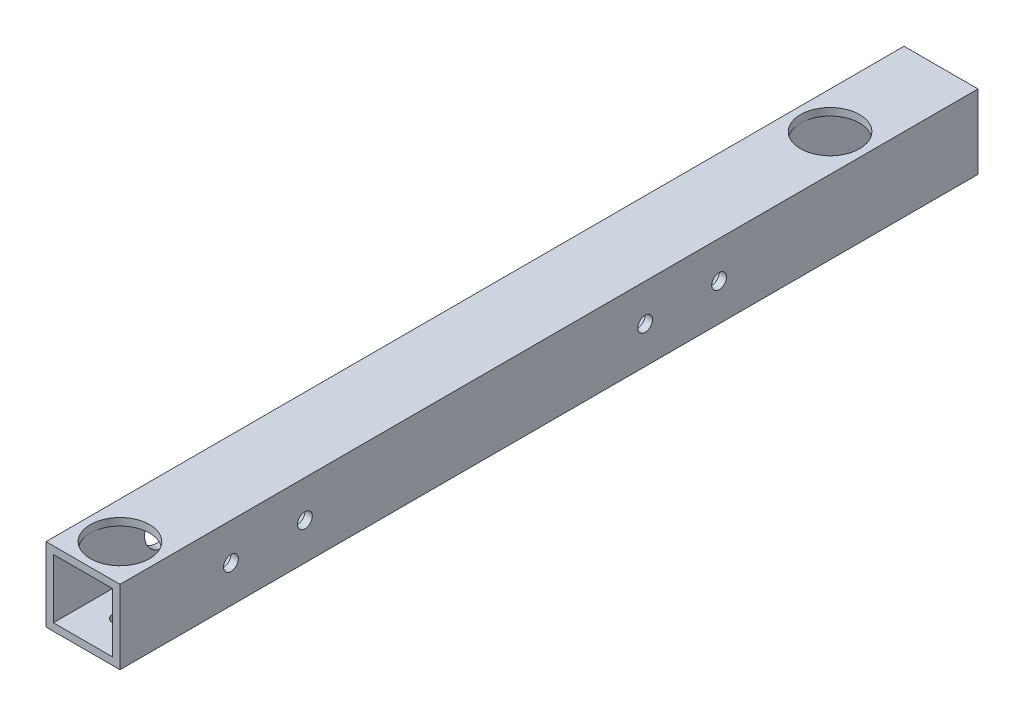
ISO-10303-21;
HEADER;
FILE_DESCRIPTION(('STEP AP214'),'2;1');
FILE_NAME('part.step','',(''),(''),'','','');
FILE_SCHEMA(('AUTOMOTIVE_DESIGN { 1 0 10303 214 1 1 1 1 }'));
ENDSEC;
DATA;
#1=APPLICATION_CONTEXT('core data for automotive mechanical design processes');
#2=APPLICATION_PROTOCOL_DEFINITION('international standard','automotive_design',2000,#1);
#3=PRODUCT_CONTEXT('',#1,'mechanical');
#4=PRODUCT('Part','Part','',(#3));
#5=PRODUCT_RELATED_PRODUCT_CATEGORY('part','',(#4));
#6=PRODUCT_DEFINITION_FORMATION('','',#4);
#7=PRODUCT_DEFINITION_CONTEXT('part definition',#1,'design');
#8=PRODUCT_DEFINITION('design','',#6,#7);
#9=PRODUCT_DEFINITION_SHAPE('','',#8);
#10=(LENGTH_UNIT() NAMED_UNIT(*) SI_UNIT(.MILLI.,.METRE.));
#11=(NAMED_UNIT(*) PLANE_ANGLE_UNIT() SI_UNIT($,.RADIAN.));
#12=(NAMED_UNIT(*) SI_UNIT($,.STERADIAN.) SOLID_ANGLE_UNIT());
#13=UNCERTAINTY_MEASURE_WITH_UNIT(LENGTH_MEASURE(1.E-05),#10,'distance_accuracy_value','');
#14=(GEOMETRIC_REPRESENTATION_CONTEXT(3) GLOBAL_UNCERTAINTY_ASSIGNED_CONTEXT((#13)) GLOBAL_UNIT_ASSIGNED_CONTEXT((#10,
#11,#12)) REPRESENTATION_CONTEXT('',''));
#15=CARTESIAN_POINT('',(0.,0.,0.));
#16=DIRECTION('',(0.,0.,1.));
#17=DIRECTION('',(1.,0.,0.));
#18=AXIS2_PLACEMENT_3D('',#15,#16,#17);
#19=CARTESIAN_POINT('',(-5.51008414074451,6.23262608579252,174.));
#20=DIRECTION('',(0.,-1.,0.));
#21=DIRECTION('',(0.,0.,-1.));
#22=AXIS2_PLACEMENT_3D('',#19,#20,#21);
#23=PLANE('',#22);
#24=CARTESIAN_POINT('',(0.489915859255486,6.23262608579252,166.5));
#25=DIRECTION('',(0.,-1.,0.));
#26=DIRECTION('',(0.,0.,-1.));
#27=AXIS2_PLACEMENT_3D('',#24,#25,#26);
#28=CIRCLE('',#27,6.);
#29=CARTESIAN_POINT('',(6.48991585925549,6.23262608579252,166.5));
#30=VERTEX_POINT('',#29);
#31=CARTESIAN_POINT('',(-5.51008414074451,6.23262608579252,166.5));
#32=VERTEX_POINT('',#31);
#33=EDGE_CURVE('E49',#30,#32,#28,.T.);
#34=ORIENTED_EDGE('',*,*,#33,.F.);
#35=DIRECTION('',(0.,0.,-1.));
#36=VECTOR('',#35,1.);
#37=CARTESIAN_POINT('',(6.48991585925549,6.23262608579252,174.));
#38=LINE('',#37,#36);
#39=CARTESIAN_POINT('',(6.48991585925549,6.23262608579252,174.));
#40=VERTEX_POINT('',#39);
#41=EDGE_CURVE('E118',#40,#30,#38,.T.);
#42=ORIENTED_EDGE('',*,*,#41,.F.);
#43=DIRECTION('',(-1.,0.,0.));
#44=VECTOR('',#43,1.);
#45=CARTESIAN_POINT('',(-5.51008414074451,6.23262608579252,174.));
#46=LINE('',#45,#44);
#47=CARTESIAN_POINT('',(-5.51008414074451,6.23262608579252,174.));
#48=VERTEX_POINT('',#47);
#49=EDGE_CURVE('E144',#40,#48,#46,.T.);
#50=ORIENTED_EDGE('',*,*,#49,.T.);
#51=DIRECTION('',(0.,0.,-1.));
#52=VECTOR('',#51,1.);
#53=CARTESIAN_POINT('',(-5.51008414074451,6.23262608579252,174.));
#54=LINE('',#53,#52);
#55=EDGE_CURVE('E121',#48,#32,#54,.T.);
#56=ORIENTED_EDGE('',*,*,#55,.T.);
#57=EDGE_LOOP('',(#34,#42,#50,#56));
#58=FACE_BOUND('',#57,.T.);
#59=ADVANCED_FACE('F33',(#58),#23,.T.);
#60=EDGE_CURVE('E109',#32,#30,#28,.T.);
#61=ORIENTED_EDGE('',*,*,#60,.F.);
#62=CARTESIAN_POINT('',(-5.51008414074451,6.23262608579252,22.5));
#63=VERTEX_POINT('',#62);
#64=EDGE_CURVE('E56',#32,#63,#54,.T.);
#65=ORIENTED_EDGE('',*,*,#64,.T.);
#66=CARTESIAN_POINT('',(0.489915859255489,6.23262608579252,22.5));
#67=DIRECTION('',(0.,-1.,0.));
#68=DIRECTION('',(0.,0.,-1.));
#69=AXIS2_PLACEMENT_3D('',#66,#67,#68);
#70=CIRCLE('',#69,6.);
#71=CARTESIAN_POINT('',(6.48991585925549,6.23262608579252,22.5));
#72=VERTEX_POINT('',#71);
#73=EDGE_CURVE('E11',#72,#63,#70,.T.);
#74=ORIENTED_EDGE('',*,*,#73,.F.);
#75=EDGE_CURVE('E123',#30,#72,#38,.T.);
#76=ORIENTED_EDGE('',*,*,#75,.F.);
#77=EDGE_LOOP('',(#61,#65,#74,#76));
#78=FACE_BOUND('',#77,.T.);
#79=ADVANCED_FACE('F124',(#78),#23,.T.);
#80=CARTESIAN_POINT('',(0.,0.,174.));
#81=DIRECTION('',(0.,0.,1.));
#82=DIRECTION('',(1.,0.,0.));
#83=AXIS2_PLACEMENT_3D('',#80,#81,#82);
#84=PLANE('',#83);
#85=DIRECTION('',(0.,-1.,0.));
#86=VECTOR('',#85,1.);
#87=CARTESIAN_POINT('',(-7.01008414074451,7.73262608579252,174.));
#88=LINE('',#87,#86);
#89=CARTESIAN_POINT('',(-7.01008414074451,7.73262608579252,174.));
#90=VERTEX_POINT('',#89);
#91=CARTESIAN_POINT('',(-7.01008414074451,-7.26737391420748,174.));
#92=VERTEX_POINT('',#91);
#93=EDGE_CURVE('E336',#90,#92,#88,.T.);
#94=ORIENTED_EDGE('',*,*,#93,.T.);
#95=DIRECTION('',(1.,0.,0.));
#96=VECTOR('',#95,1.);
#97=CARTESIAN_POINT('',(-7.01008414074451,-7.26737391420748,174.));
#98=LINE('',#97,#96);
#99=CARTESIAN_POINT('',(7.98991585925548,-7.26737391420748,174.));
#100=VERTEX_POINT('',#99);
#101=EDGE_CURVE('E339',#92,#100,#98,.T.);
#102=ORIENTED_EDGE('',*,*,#101,.T.);
#103=DIRECTION('',(0.,1.,0.));
#104=VECTOR('',#103,1.);
#105=CARTESIAN_POINT('',(7.98991585925549,7.73262608579252,174.));
#106=LINE('',#105,#104);
#107=CARTESIAN_POINT('',(7.98991585925549,7.73262608579252,174.));
#108=VERTEX_POINT('',#107);
#109=EDGE_CURVE('E412',#100,#108,#106,.T.);
#110=ORIENTED_EDGE('',*,*,#109,.T.);
#111=DIRECTION('',(-1.,0.,0.));
#112=VECTOR('',#111,1.);
#113=CARTESIAN_POINT('',(-7.01008414074451,7.73262608579252,174.));
#114=LINE('',#113,#112);
#115=EDGE_CURVE('E329',#108,#90,#114,.T.);
#116=ORIENTED_EDGE('',*,*,#115,.T.);
#117=EDGE_LOOP('',(#94,#102,#110,#116));
#118=FACE_BOUND('',#117,.T.);
#119=DIRECTION('',(1.,0.,0.));
#120=VECTOR('',#119,1.);
#121=CARTESIAN_POINT('',(-5.51008414074451,-5.76737391420748,174.));
#122=LINE('',#121,#120);
#123=CARTESIAN_POINT('',(-5.51008414074451,-5.76737391420748,174.));
#124=VERTEX_POINT('',#123);
#125=CARTESIAN_POINT('',(6.48991585925549,-5.76737391420748,174.));
#126=VERTEX_POINT('',#125);
#127=EDGE_CURVE('E150',#124,#126,#122,.T.);
#128=ORIENTED_EDGE('',*,*,#127,.F.);
#129=DIRECTION('',(0.,-1.,0.));
#130=VECTOR('',#129,1.);
#131=CARTESIAN_POINT('',(-5.51008414074451,6.23262608579252,174.));
#132=LINE('',#131,#130);
#133=EDGE_CURVE('E165',#48,#124,#132,.T.);
#134=ORIENTED_EDGE('',*,*,#133,.F.);
#135=ORIENTED_EDGE('',*,*,#49,.F.);
#136=DIRECTION('',(0.,1.,0.));
#137=VECTOR('',#136,1.);
#138=CARTESIAN_POINT('',(6.48991585925549,6.23262608579252,174.));
#139=LINE('',#138,#137);
#140=EDGE_CURVE('E134',#126,#40,#139,.T.);
#141=ORIENTED_EDGE('',*,*,#140,.F.);
#142=EDGE_LOOP('',(#128,#134,#135,#141));
#143=FACE_BOUND('',#142,.T.);
#144=ADVANCED_FACE('F359',(#118,#143),#84,.T.);
#145=CARTESIAN_POINT('',(0.,0.,0.));
#146=DIRECTION('',(0.,0.,1.));
#147=DIRECTION('',(1.,0.,0.));
#148=AXIS2_PLACEMENT_3D('',#145,#146,#147);
#149=PLANE('',#148);
#150=DIRECTION('',(0.,-1.,0.));
#151=VECTOR('',#150,1.);
#152=CARTESIAN_POINT('',(-7.01008414074451,7.73262608579252,0.));
#153=LINE('',#152,#151);
#154=CARTESIAN_POINT('',(-7.01008414074451,7.73262608579252,0.));
#155=VERTEX_POINT('',#154);
#156=CARTESIAN_POINT('',(-7.01008414074451,-7.26737391420748,0.));
#157=VERTEX_POINT('',#156);
#158=EDGE_CURVE('E335',#155,#157,#153,.T.);
#159=ORIENTED_EDGE('',*,*,#158,.F.);
#160=DIRECTION('',(-1.,0.,0.));
#161=VECTOR('',#160,1.);
#162=CARTESIAN_POINT('',(-7.01008414074451,7.73262608579252,0.));
#163=LINE('',#162,#161);
#164=CARTESIAN_POINT('',(7.98991585925549,7.73262608579252,0.));
#165=VERTEX_POINT('',#164);
#166=EDGE_CURVE('E323',#165,#155,#163,.T.);
#167=ORIENTED_EDGE('',*,*,#166,.F.);
#168=DIRECTION('',(0.,1.,0.));
#169=VECTOR('',#168,1.);
#170=CARTESIAN_POINT('',(7.98991585925549,7.73262608579252,0.));
#171=LINE('',#170,#169);
#172=CARTESIAN_POINT('',(7.98991585925548,-7.26737391420748,0.));
#173=VERTEX_POINT('',#172);
#174=EDGE_CURVE('E314',#173,#165,#171,.T.);
#175=ORIENTED_EDGE('',*,*,#174,.F.);
#176=DIRECTION('',(1.,0.,0.));
#177=VECTOR('',#176,1.);
#178=CARTESIAN_POINT('',(-7.01008414074451,-7.26737391420748,0.));
#179=LINE('',#178,#177);
#180=EDGE_CURVE('E324',#157,#173,#179,.T.);
#181=ORIENTED_EDGE('',*,*,#180,.F.);
#182=EDGE_LOOP('',(#159,#167,#175,#181));
#183=FACE_BOUND('',#182,.T.);
#184=DIRECTION('',(0.,-1.,0.));
#185=VECTOR('',#184,1.);
#186=CARTESIAN_POINT('',(-5.51008414074451,6.23262608579252,0.));
#187=LINE('',#186,#185);
#188=CARTESIAN_POINT('',(-5.51008414074451,6.23262608579252,0.));
#189=VERTEX_POINT('',#188);
#190=CARTESIAN_POINT('',(-5.51008414074451,-5.76737391420748,0.));
#191=VERTEX_POINT('',#190);
#192=EDGE_CURVE('E154',#189,#191,#187,.T.);
#193=ORIENTED_EDGE('',*,*,#192,.T.);
#194=DIRECTION('',(1.,0.,0.));
#195=VECTOR('',#194,1.);
#196=CARTESIAN_POINT('',(-5.51008414074451,-5.76737391420748,0.));
#197=LINE('',#196,#195);
#198=CARTESIAN_POINT('',(6.48991585925549,-5.76737391420748,0.));
#199=VERTEX_POINT('',#198);
#200=EDGE_CURVE('E157',#191,#199,#197,.T.);
#201=ORIENTED_EDGE('',*,*,#200,.T.);
#202=DIRECTION('',(0.,1.,0.));
#203=VECTOR('',#202,1.);
#204=CARTESIAN_POINT('',(6.48991585925549,6.23262608579252,0.));
#205=LINE('',#204,#203);
#206=CARTESIAN_POINT('',(6.48991585925549,6.23262608579252,0.));
#207=VERTEX_POINT('',#206);
#208=EDGE_CURVE('E161',#199,#207,#205,.T.);
#209=ORIENTED_EDGE('',*,*,#208,.T.);
#210=DIRECTION('',(-1.,0.,0.));
#211=VECTOR('',#210,1.);
#212=CARTESIAN_POINT('',(-5.51008414074451,6.23262608579252,0.));
#213=LINE('',#212,#211);
#214=EDGE_CURVE('E163',#207,#189,#213,.T.);
#215=ORIENTED_EDGE('',*,*,#214,.T.);
#216=EDGE_LOOP('',(#193,#201,#209,#215));
#217=FACE_BOUND('',#216,.T.);
#218=ADVANCED_FACE('F333',(#183,#217),#149,.F.);
#219=CARTESIAN_POINT('',(-7.01008414074451,7.73262608579252,174.));
#220=DIRECTION('',(1.,0.,0.));
#221=DIRECTION('',(0.,1.,0.));
#222=AXIS2_PLACEMENT_3D('',#219,#220,#221);
#223=PLANE('',#222);
#224=CARTESIAN_POINT('',(-7.01008414074451,0.232626085792519,136.5));
#225=DIRECTION('',(-1.,0.,0.));
#226=DIRECTION('',(0.,-1.,0.));
#227=AXIS2_PLACEMENT_3D('',#224,#225,#226);
#228=CIRCLE('',#227,3.99999999999999);
#229=CARTESIAN_POINT('',(-7.01008414074451,-3.76737391420747,136.5));
#230=VERTEX_POINT('',#229);
#231=EDGE_CURVE('E232',#230,#230,#228,.T.);
#232=ORIENTED_EDGE('',*,*,#231,.F.);
#233=EDGE_LOOP('',(#232));
#234=FACE_BOUND('',#233,.T.);
#235=CARTESIAN_POINT('',(-7.01008414074451,0.232626085792519,67.5));
#236=DIRECTION('',(-1.,0.,0.));
#237=DIRECTION('',(0.,-1.,0.));
#238=AXIS2_PLACEMENT_3D('',#235,#236,#237);
#239=CIRCLE('',#238,4.00000000000001);
#240=CARTESIAN_POINT('',(-7.01008414074451,-3.76737391420749,67.5));
#241=VERTEX_POINT('',#240);
#242=EDGE_CURVE('E221',#241,#241,#239,.T.);
#243=ORIENTED_EDGE('',*,*,#242,.F.);
#244=EDGE_LOOP('',(#243));
#245=FACE_BOUND('',#244,.T.);
#246=CARTESIAN_POINT('',(-7.01008414074451,0.232626085792518,116.8));
#247=DIRECTION('',(-1.,0.,0.));
#248=DIRECTION('',(0.,-1.,0.));
#249=AXIS2_PLACEMENT_3D('',#246,#247,#248);
#250=CIRCLE('',#249,1.5);
#251=CARTESIAN_POINT('',(-7.01008414074451,-1.26737391420748,116.8));
#252=VERTEX_POINT('',#251);
#253=EDGE_CURVE('E201',#252,#252,#250,.T.);
#254=ORIENTED_EDGE('',*,*,#253,.F.);
#255=EDGE_LOOP('',(#254));
#256=FACE_BOUND('',#255,.T.);
#257=CARTESIAN_POINT('',(-7.01008414074451,0.232626085792518,86.8));
#258=DIRECTION('',(-1.,0.,0.));
#259=DIRECTION('',(0.,-1.,0.));
#260=AXIS2_PLACEMENT_3D('',#257,#258,#259);
#261=CIRCLE('',#260,1.5);
#262=CARTESIAN_POINT('',(-7.01008414074451,-1.26737391420748,86.8));
#263=VERTEX_POINT('',#262);
#264=EDGE_CURVE('E193',#263,#263,#261,.T.);
#265=ORIENTED_EDGE('',*,*,#264,.F.);
#266=EDGE_LOOP('',(#265));
#267=FACE_BOUND('',#266,.T.);
#268=CARTESIAN_POINT('',(-7.01008414074451,0.232626085792515,151.5));
#269=DIRECTION('',(-1.,0.,0.));
#270=DIRECTION('',(0.,-1.,0.));
#271=AXIS2_PLACEMENT_3D('',#268,#269,#270);
#272=CIRCLE('',#271,3.99999999999999);
#273=CARTESIAN_POINT('',(-7.01008414074451,-3.76737391420748,151.5));
#274=VERTEX_POINT('',#273);
#275=EDGE_CURVE('E189',#274,#274,#272,.T.);
#276=ORIENTED_EDGE('',*,*,#275,.F.);
#277=EDGE_LOOP('',(#276));
#278=FACE_BOUND('',#277,.T.);
#279=CARTESIAN_POINT('',(-7.01008414074451,0.232626085792518,52.5));
#280=DIRECTION('',(-1.,0.,0.));
#281=DIRECTION('',(0.,-1.,0.));
#282=AXIS2_PLACEMENT_3D('',#279,#280,#281);
#283=CIRCLE('',#282,4.);
#284=CARTESIAN_POINT('',(-7.01008414074451,-3.76737391420748,52.5));
#285=VERTEX_POINT('',#284);
#286=EDGE_CURVE('E181',#285,#285,#283,.T.);
#287=ORIENTED_EDGE('',*,*,#286,.F.);
#288=EDGE_LOOP('',(#287));
#289=FACE_BOUND('',#288,.T.);
#290=ORIENTED_EDGE('',*,*,#158,.T.);
#291=DIRECTION('',(0.,0.,-1.));
#292=VECTOR('',#291,1.);
#293=CARTESIAN_POINT('',(-7.01008414074451,-7.26737391420748,174.));
#294=LINE('',#293,#292);
#295=EDGE_CURVE('E277',#92,#157,#294,.T.);
#296=ORIENTED_EDGE('',*,*,#295,.F.);
#297=ORIENTED_EDGE('',*,*,#93,.F.);
#298=DIRECTION('',(0.,0.,-1.));
#299=VECTOR('',#298,1.);
#300=CARTESIAN_POINT('',(-7.01008414074451,7.73262608579252,174.));
#301=LINE('',#300,#299);
#302=EDGE_CURVE('E330',#90,#155,#301,.T.);
#303=ORIENTED_EDGE('',*,*,#302,.T.);
#304=EDGE_LOOP('',(#290,#296,#297,#303));
#305=FACE_BOUND('',#304,.T.);
#306=ADVANCED_FACE('F35',(#234,#245,#256,#267,#278,#289,#305),#223,.F.);
#307=CARTESIAN_POINT('',(-7.01008414074451,-7.26737391420748,174.));
#308=DIRECTION('',(0.,1.,0.));
#309=DIRECTION('',(0.,0.,1.));
#310=AXIS2_PLACEMENT_3D('',#307,#308,#309);
#311=PLANE('',#310);
#312=CARTESIAN_POINT('',(0.489915859255487,-7.26737391420748,166.5));
#313=DIRECTION('',(0.,-1.,0.));
#314=DIRECTION('',(0.,0.,-1.));
#315=AXIS2_PLACEMENT_3D('',#312,#313,#314);
#316=CIRCLE('',#315,1.5);
#317=CARTESIAN_POINT('',(0.489915859255487,-7.26737391420748,165.));
#318=VERTEX_POINT('',#317);
#319=EDGE_CURVE('E122',#318,#318,#316,.T.);
#320=ORIENTED_EDGE('',*,*,#319,.F.);
#321=EDGE_LOOP('',(#320));
#322=FACE_BOUND('',#321,.T.);
#323=CARTESIAN_POINT('',(0.489915859255487,-7.26737391420748,22.5));
#324=DIRECTION('',(0.,-1.,0.));
#325=DIRECTION('',(0.,0.,-1.));
#326=AXIS2_PLACEMENT_3D('',#323,#324,#325);
#327=CIRCLE('',#326,1.5);
#328=CARTESIAN_POINT('',(0.489915859255487,-7.26737391420748,21.));
#329=VERTEX_POINT('',#328);
#330=EDGE_CURVE('E209',#329,#329,#327,.T.);
#331=ORIENTED_EDGE('',*,*,#330,.F.);
#332=EDGE_LOOP('',(#331));
#333=FACE_BOUND('',#332,.T.);
#334=CARTESIAN_POINT('',(0.489915859255486,-7.26737391420748,116.8));
#335=DIRECTION('',(0.,-1.,0.));
#336=DIRECTION('',(0.,0.,-1.));
#337=AXIS2_PLACEMENT_3D('',#334,#335,#336);
#338=CIRCLE('',#337,4.);
#339=CARTESIAN_POINT('',(0.489915859255486,-7.26737391420748,112.8));
#340=VERTEX_POINT('',#339);
#341=EDGE_CURVE('E205',#340,#340,#338,.T.);
#342=ORIENTED_EDGE('',*,*,#341,.F.);
#343=EDGE_LOOP('',(#342));
#344=FACE_BOUND('',#343,.T.);
#345=CARTESIAN_POINT('',(0.489915859255486,-7.26737391420748,86.8));
#346=DIRECTION('',(0.,-1.,0.));
#347=DIRECTION('',(0.,0.,-1.));
#348=AXIS2_PLACEMENT_3D('',#345,#346,#347);
#349=CIRCLE('',#348,4.);
#350=CARTESIAN_POINT('',(0.489915859255486,-7.26737391420748,82.8));
#351=VERTEX_POINT('',#350);
#352=EDGE_CURVE('E197',#351,#351,#349,.T.);
#353=ORIENTED_EDGE('',*,*,#352,.F.);
#354=EDGE_LOOP('',(#353));
#355=FACE_BOUND('',#354,.T.);
#356=CARTESIAN_POINT('',(0.489915859255487,-7.26737391420748,7.5));
#357=DIRECTION('',(0.,-1.,0.));
#358=DIRECTION('',(0.,0.,-1.));
#359=AXIS2_PLACEMENT_3D('',#356,#357,#358);
#360=CIRCLE('',#359,1.5);
#361=CARTESIAN_POINT('',(0.489915859255487,-7.26737391420748,6.));
#362=VERTEX_POINT('',#361);
#363=EDGE_CURVE('E173',#362,#362,#360,.T.);
#364=ORIENTED_EDGE('',*,*,#363,.F.);
#365=EDGE_LOOP('',(#364));
#366=FACE_BOUND('',#365,.T.);
#367=ORIENTED_EDGE('',*,*,#180,.T.);
#368=DIRECTION('',(0.,0.,-1.));
#369=VECTOR('',#368,1.);
#370=CARTESIAN_POINT('',(7.98991585925548,-7.26737391420748,174.));
#371=LINE('',#370,#369);
#372=EDGE_CURVE('E320',#100,#173,#371,.T.);
#373=ORIENTED_EDGE('',*,*,#372,.F.);
#374=ORIENTED_EDGE('',*,*,#101,.F.);
#375=ORIENTED_EDGE('',*,*,#295,.T.);
#376=EDGE_LOOP('',(#367,#373,#374,#375));
#377=FACE_BOUND('',#376,.T.);
#378=ADVANCED_FACE('F304',(#322,#333,#344,#355,#366,#377),#311,.F.);
#379=CARTESIAN_POINT('',(7.98991585925549,7.73262608579252,174.));
#380=DIRECTION('',(-1.,0.,0.));
#381=DIRECTION('',(0.,-1.,0.));
#382=AXIS2_PLACEMENT_3D('',#379,#380,#381);
#383=PLANE('',#382);
#384=CARTESIAN_POINT('',(7.98991585925548,0.232626085792518,136.5));
#385=DIRECTION('',(1.,0.,0.));
#386=DIRECTION('',(0.,1.,0.));
#387=AXIS2_PLACEMENT_3D('',#384,#385,#386);
#388=CIRCLE('',#387,1.5);
#389=CARTESIAN_POINT('',(7.98991585925548,1.73262608579252,136.5));
#390=VERTEX_POINT('',#389);
#391=EDGE_CURVE('E229',#390,#390,#388,.T.);
#392=ORIENTED_EDGE('',*,*,#391,.F.);
#393=EDGE_LOOP('',(#392));
#394=FACE_BOUND('',#393,.T.);
#395=CARTESIAN_POINT('',(7.98991585925548,0.232626085792519,67.5));
#396=DIRECTION('',(1.,0.,0.));
#397=DIRECTION('',(0.,1.,0.));
#398=AXIS2_PLACEMENT_3D('',#395,#396,#397);
#399=CIRCLE('',#398,1.5);
#400=CARTESIAN_POINT('',(7.98991585925548,1.73262608579252,67.5));
#401=VERTEX_POINT('',#400);
#402=EDGE_CURVE('E225',#401,#401,#399,.T.);
#403=ORIENTED_EDGE('',*,*,#402,.F.);
#404=EDGE_LOOP('',(#403));
#405=FACE_BOUND('',#404,.T.);
#406=CARTESIAN_POINT('',(7.98991585925548,0.232626085792518,151.5));
#407=DIRECTION('',(1.,0.,0.));
#408=DIRECTION('',(0.,1.,0.));
#409=AXIS2_PLACEMENT_3D('',#406,#407,#408);
#410=CIRCLE('',#409,1.5);
#411=CARTESIAN_POINT('',(7.98991585925548,1.73262608579252,151.5));
#412=VERTEX_POINT('',#411);
#413=EDGE_CURVE('E185',#412,#412,#410,.T.);
#414=ORIENTED_EDGE('',*,*,#413,.F.);
#415=EDGE_LOOP('',(#414));
#416=FACE_BOUND('',#415,.T.);
#417=CARTESIAN_POINT('',(7.98991585925548,0.232626085792512,52.5));
#418=DIRECTION('',(1.,0.,0.));
#419=DIRECTION('',(0.,1.,0.));
#420=AXIS2_PLACEMENT_3D('',#417,#418,#419);
#421=CIRCLE('',#420,1.5);
#422=CARTESIAN_POINT('',(7.98991585925548,1.73262608579252,52.5));
#423=VERTEX_POINT('',#422);
#424=EDGE_CURVE('E177',#423,#423,#421,.T.);
#425=ORIENTED_EDGE('',*,*,#424,.F.);
#426=EDGE_LOOP('',(#425));
#427=FACE_BOUND('',#426,.T.);
#428=ORIENTED_EDGE('',*,*,#174,.T.);
#429=DIRECTION('',(0.,0.,-1.));
#430=VECTOR('',#429,1.);
#431=CARTESIAN_POINT('',(7.98991585925549,7.73262608579252,174.));
#432=LINE('',#431,#430);
#433=EDGE_CURVE('E317',#108,#165,#432,.T.);
#434=ORIENTED_EDGE('',*,*,#433,.F.);
#435=ORIENTED_EDGE('',*,*,#109,.F.);
#436=ORIENTED_EDGE('',*,*,#372,.T.);
#437=EDGE_LOOP('',(#428,#434,#435,#436));
#438=FACE_BOUND('',#437,.T.);
#439=ADVANCED_FACE('F301',(#394,#405,#416,#427,#438),#383,.F.);
#440=CARTESIAN_POINT('',(-7.01008414074451,7.73262608579252,174.));
#441=DIRECTION('',(0.,-1.,0.));
#442=DIRECTION('',(0.,0.,-1.));
#443=AXIS2_PLACEMENT_3D('',#440,#441,#442);
#444=PLANE('',#443);
#445=CARTESIAN_POINT('',(0.489915859255486,7.73262608579252,166.5));
#446=DIRECTION('',(0.,1.,0.));
#447=DIRECTION('',(0.,0.,1.));
#448=AXIS2_PLACEMENT_3D('',#445,#446,#447);
#449=CIRCLE('',#448,6.);
#450=CARTESIAN_POINT('',(0.489915859255486,7.73262608579252,172.5));
#451=VERTEX_POINT('',#450);
#452=EDGE_CURVE('E113',#451,#451,#449,.T.);
#453=ORIENTED_EDGE('',*,*,#452,.F.);
#454=EDGE_LOOP('',(#453));
#455=FACE_BOUND('',#454,.T.);
#456=CARTESIAN_POINT('',(0.489915859255489,7.73262608579252,22.5));
#457=DIRECTION('',(0.,1.,0.));
#458=DIRECTION('',(0.,0.,1.));
#459=AXIS2_PLACEMENT_3D('',#456,#457,#458);
#460=CIRCLE('',#459,6.);
#461=CARTESIAN_POINT('',(0.489915859255489,7.73262608579252,28.5));
#462=VERTEX_POINT('',#461);
#463=EDGE_CURVE('E212',#462,#462,#460,.T.);
#464=ORIENTED_EDGE('',*,*,#463,.F.);
#465=EDGE_LOOP('',(#464));
#466=FACE_BOUND('',#465,.T.);
#467=ORIENTED_EDGE('',*,*,#166,.T.);
#468=ORIENTED_EDGE('',*,*,#302,.F.);
#469=ORIENTED_EDGE('',*,*,#115,.F.);
#470=ORIENTED_EDGE('',*,*,#433,.T.);
#471=EDGE_LOOP('',(#467,#468,#469,#470));
#472=FACE_BOUND('',#471,.T.);
#473=ADVANCED_FACE('F245',(#455,#466,#472),#444,.F.);
#474=CARTESIAN_POINT('',(-5.51008414074451,6.23262608579252,174.));
#475=DIRECTION('',(1.,0.,0.));
#476=DIRECTION('',(0.,1.,0.));
#477=AXIS2_PLACEMENT_3D('',#474,#475,#476);
#478=PLANE('',#477);
#479=CARTESIAN_POINT('',(-5.51008414074451,0.232626085792519,136.5));
#480=DIRECTION('',(1.,0.,0.));
#481=DIRECTION('',(0.,1.,0.));
#482=AXIS2_PLACEMENT_3D('',#479,#480,#481);
#483=CIRCLE('',#482,3.99999999999999);
#484=CARTESIAN_POINT('',(-5.51008414074451,4.23262608579251,136.5));
#485=VERTEX_POINT('',#484);
#486=EDGE_CURVE('E37',#485,#485,#483,.T.);
#487=ORIENTED_EDGE('',*,*,#486,.F.);
#488=EDGE_LOOP('',(#487));
#489=FACE_BOUND('',#488,.T.);
#490=CARTESIAN_POINT('',(-5.51008414074451,0.232626085792519,67.5));
#491=DIRECTION('',(1.,0.,0.));
#492=DIRECTION('',(0.,1.,0.));
#493=AXIS2_PLACEMENT_3D('',#490,#491,#492);
#494=CIRCLE('',#493,4.00000000000001);
#495=CARTESIAN_POINT('',(-5.51008414074451,4.23262608579253,67.5));
#496=VERTEX_POINT('',#495);
#497=EDGE_CURVE('E220',#496,#496,#494,.T.);
#498=ORIENTED_EDGE('',*,*,#497,.F.);
#499=EDGE_LOOP('',(#498));
#500=FACE_BOUND('',#499,.T.);
#501=ORIENTED_EDGE('',*,*,#64,.F.);
#502=ORIENTED_EDGE('',*,*,#55,.F.);
#503=ORIENTED_EDGE('',*,*,#133,.T.);
#504=DIRECTION('',(0.,0.,-1.));
#505=VECTOR('',#504,1.);
#506=CARTESIAN_POINT('',(-5.51008414074451,-5.76737391420748,174.));
#507=LINE('',#506,#505);
#508=EDGE_CURVE('E137',#124,#191,#507,.T.);
#509=ORIENTED_EDGE('',*,*,#508,.T.);
#510=ORIENTED_EDGE('',*,*,#192,.F.);
#511=EDGE_CURVE('E142',#63,#189,#54,.T.);
#512=ORIENTED_EDGE('',*,*,#511,.F.);
#513=EDGE_LOOP('',(#501,#502,#503,#509,#510,#512));
#514=FACE_BOUND('',#513,.T.);
#515=CARTESIAN_POINT('',(-5.51008414074451,0.232626085792519,116.8));
#516=DIRECTION('',(1.,0.,0.));
#517=DIRECTION('',(0.,1.,0.));
#518=AXIS2_PLACEMENT_3D('',#515,#516,#517);
#519=CIRCLE('',#518,1.5);
#520=CARTESIAN_POINT('',(-5.51008414074451,1.73262608579252,116.8));
#521=VERTEX_POINT('',#520);
#522=EDGE_CURVE('E200',#521,#521,#519,.T.);
#523=ORIENTED_EDGE('',*,*,#522,.F.);
#524=EDGE_LOOP('',(#523));
#525=FACE_BOUND('',#524,.T.);
#526=CARTESIAN_POINT('',(-5.51008414074451,0.232626085792519,86.8));
#527=DIRECTION('',(1.,0.,0.));
#528=DIRECTION('',(0.,1.,0.));
#529=AXIS2_PLACEMENT_3D('',#526,#527,#528);
#530=CIRCLE('',#529,1.5);
#531=CARTESIAN_POINT('',(-5.51008414074451,1.73262608579252,86.8));
#532=VERTEX_POINT('',#531);
#533=EDGE_CURVE('E192',#532,#532,#530,.T.);
#534=ORIENTED_EDGE('',*,*,#533,.F.);
#535=EDGE_LOOP('',(#534));
#536=FACE_BOUND('',#535,.T.);
#537=CARTESIAN_POINT('',(-5.51008414074451,0.232626085792516,151.5));
#538=DIRECTION('',(1.,0.,0.));
#539=DIRECTION('',(0.,1.,0.));
#540=AXIS2_PLACEMENT_3D('',#537,#538,#539);
#541=CIRCLE('',#540,3.99999999999999);
#542=CARTESIAN_POINT('',(-5.51008414074451,4.23262608579251,151.5));
#543=VERTEX_POINT('',#542);
#544=EDGE_CURVE('E188',#543,#543,#541,.T.);
#545=ORIENTED_EDGE('',*,*,#544,.F.);
#546=EDGE_LOOP('',(#545));
#547=FACE_BOUND('',#546,.T.);
#548=CARTESIAN_POINT('',(-5.51008414074451,0.232626085792519,52.5));
#549=DIRECTION('',(1.,0.,0.));
#550=DIRECTION('',(0.,1.,0.));
#551=AXIS2_PLACEMENT_3D('',#548,#549,#550);
#552=CIRCLE('',#551,4.);
#553=CARTESIAN_POINT('',(-5.51008414074451,4.23262608579252,52.5));
#554=VERTEX_POINT('',#553);
#555=EDGE_CURVE('E180',#554,#554,#552,.T.);
#556=ORIENTED_EDGE('',*,*,#555,.F.);
#557=EDGE_LOOP('',(#556));
#558=FACE_BOUND('',#557,.T.);
#559=ADVANCED_FACE('F241',(#489,#500,#514,#525,#536,#547,#558),#478,.T.);
#560=CARTESIAN_POINT('',(-5.51008414074451,-5.76737391420748,174.));
#561=DIRECTION('',(0.,1.,0.));
#562=DIRECTION('',(0.,0.,1.));
#563=AXIS2_PLACEMENT_3D('',#560,#561,#562);
#564=PLANE('',#563);
#565=CARTESIAN_POINT('',(0.489915859255487,-5.76737391420748,166.5));
#566=DIRECTION('',(0.,1.,0.));
#567=DIRECTION('',(0.,0.,1.));
#568=AXIS2_PLACEMENT_3D('',#565,#566,#567);
#569=CIRCLE('',#568,1.5);
#570=CARTESIAN_POINT('',(0.489915859255487,-5.76737391420748,168.));
#571=VERTEX_POINT('',#570);
#572=EDGE_CURVE('E215',#571,#571,#569,.T.);
#573=ORIENTED_EDGE('',*,*,#572,.F.);
#574=EDGE_LOOP('',(#573));
#575=FACE_BOUND('',#574,.T.);
#576=CARTESIAN_POINT('',(0.489915859255487,-5.76737391420748,22.5));
#577=DIRECTION('',(0.,1.,0.));
#578=DIRECTION('',(0.,0.,1.));
#579=AXIS2_PLACEMENT_3D('',#576,#577,#578);
#580=CIRCLE('',#579,1.5);
#581=CARTESIAN_POINT('',(0.489915859255487,-5.76737391420748,24.));
#582=VERTEX_POINT('',#581);
#583=EDGE_CURVE('E208',#582,#582,#580,.T.);
#584=ORIENTED_EDGE('',*,*,#583,.F.);
#585=EDGE_LOOP('',(#584));
#586=FACE_BOUND('',#585,.T.);
#587=CARTESIAN_POINT('',(0.489915859255486,-5.76737391420748,116.8));
#588=DIRECTION('',(0.,1.,0.));
#589=DIRECTION('',(0.,0.,1.));
#590=AXIS2_PLACEMENT_3D('',#587,#588,#589);
#591=CIRCLE('',#590,4.);
#592=CARTESIAN_POINT('',(0.489915859255486,-5.76737391420748,120.8));
#593=VERTEX_POINT('',#592);
#594=EDGE_CURVE('E204',#593,#593,#591,.T.);
#595=ORIENTED_EDGE('',*,*,#594,.F.);
#596=EDGE_LOOP('',(#595));
#597=FACE_BOUND('',#596,.T.);
#598=CARTESIAN_POINT('',(0.489915859255486,-5.76737391420748,86.8));
#599=DIRECTION('',(0.,1.,0.));
#600=DIRECTION('',(0.,0.,1.));
#601=AXIS2_PLACEMENT_3D('',#598,#599,#600);
#602=CIRCLE('',#601,4.);
#603=CARTESIAN_POINT('',(0.489915859255486,-5.76737391420748,90.8));
#604=VERTEX_POINT('',#603);
#605=EDGE_CURVE('E196',#604,#604,#602,.T.);
#606=ORIENTED_EDGE('',*,*,#605,.F.);
#607=EDGE_LOOP('',(#606));
#608=FACE_BOUND('',#607,.T.);
#609=CARTESIAN_POINT('',(0.489915859255487,-5.76737391420748,7.5));
#610=DIRECTION('',(0.,1.,0.));
#611=DIRECTION('',(0.,0.,1.));
#612=AXIS2_PLACEMENT_3D('',#609,#610,#611);
#613=CIRCLE('',#612,1.5);
#614=CARTESIAN_POINT('',(0.489915859255487,-5.76737391420748,9.));
#615=VERTEX_POINT('',#614);
#616=EDGE_CURVE('E158',#615,#615,#613,.T.);
#617=ORIENTED_EDGE('',*,*,#616,.F.);
#618=EDGE_LOOP('',(#617));
#619=FACE_BOUND('',#618,.T.);
#620=ORIENTED_EDGE('',*,*,#200,.F.);
#621=ORIENTED_EDGE('',*,*,#508,.F.);
#622=ORIENTED_EDGE('',*,*,#127,.T.);
#623=DIRECTION('',(0.,0.,-1.));
#624=VECTOR('',#623,1.);
#625=CARTESIAN_POINT('',(6.48991585925549,-5.76737391420748,174.));
#626=LINE('',#625,#624);
#627=EDGE_CURVE('E136',#126,#199,#626,.T.);
#628=ORIENTED_EDGE('',*,*,#627,.T.);
#629=EDGE_LOOP('',(#620,#621,#622,#628));
#630=FACE_BOUND('',#629,.T.);
#631=ADVANCED_FACE('F244',(#575,#586,#597,#608,#619,#630),#564,.T.);
#632=CARTESIAN_POINT('',(6.48991585925549,6.23262608579252,174.));
#633=DIRECTION('',(-1.,0.,0.));
#634=DIRECTION('',(0.,-1.,0.));
#635=AXIS2_PLACEMENT_3D('',#632,#633,#634);
#636=PLANE('',#635);
#637=CARTESIAN_POINT('',(6.48991585925549,0.232626085792519,136.5));
#638=DIRECTION('',(-1.,0.,0.));
#639=DIRECTION('',(0.,-1.,0.));
#640=AXIS2_PLACEMENT_3D('',#637,#638,#639);
#641=CIRCLE('',#640,1.5);
#642=CARTESIAN_POINT('',(6.48991585925549,-1.26737391420748,136.5));
#643=VERTEX_POINT('',#642);
#644=EDGE_CURVE('E228',#643,#643,#641,.T.);
#645=ORIENTED_EDGE('',*,*,#644,.F.);
#646=EDGE_LOOP('',(#645));
#647=FACE_BOUND('',#646,.T.);
#648=CARTESIAN_POINT('',(6.48991585925549,0.232626085792519,67.5));
#649=DIRECTION('',(-1.,0.,0.));
#650=DIRECTION('',(0.,-1.,0.));
#651=AXIS2_PLACEMENT_3D('',#648,#649,#650);
#652=CIRCLE('',#651,1.5);
#653=CARTESIAN_POINT('',(6.48991585925549,-1.26737391420748,67.5));
#654=VERTEX_POINT('',#653);
#655=EDGE_CURVE('E224',#654,#654,#652,.T.);
#656=ORIENTED_EDGE('',*,*,#655,.F.);
#657=EDGE_LOOP('',(#656));
#658=FACE_BOUND('',#657,.T.);
#659=ORIENTED_EDGE('',*,*,#41,.T.);
#660=ORIENTED_EDGE('',*,*,#75,.T.);
#661=EDGE_CURVE('E128',#72,#207,#38,.T.);
#662=ORIENTED_EDGE('',*,*,#661,.T.);
#663=ORIENTED_EDGE('',*,*,#208,.F.);
#664=ORIENTED_EDGE('',*,*,#627,.F.);
#665=ORIENTED_EDGE('',*,*,#140,.T.);
#666=EDGE_LOOP('',(#659,#660,#662,#663,#664,#665));
#667=FACE_BOUND('',#666,.T.);
#668=CARTESIAN_POINT('',(6.48991585925549,0.232626085792519,151.5));
#669=DIRECTION('',(-1.,0.,0.));
#670=DIRECTION('',(0.,-1.,0.));
#671=AXIS2_PLACEMENT_3D('',#668,#669,#670);
#672=CIRCLE('',#671,1.5);
#673=CARTESIAN_POINT('',(6.48991585925549,-1.26737391420748,151.5));
#674=VERTEX_POINT('',#673);
#675=EDGE_CURVE('E184',#674,#674,#672,.T.);
#676=ORIENTED_EDGE('',*,*,#675,.F.);
#677=EDGE_LOOP('',(#676));
#678=FACE_BOUND('',#677,.T.);
#679=CARTESIAN_POINT('',(6.48991585925549,0.232626085792512,52.5));
#680=DIRECTION('',(-1.,0.,0.));
#681=DIRECTION('',(0.,-1.,0.));
#682=AXIS2_PLACEMENT_3D('',#679,#680,#681);
#683=CIRCLE('',#682,1.5);
#684=CARTESIAN_POINT('',(6.48991585925549,-1.26737391420749,52.5));
#685=VERTEX_POINT('',#684);
#686=EDGE_CURVE('E176',#685,#685,#683,.T.);
#687=ORIENTED_EDGE('',*,*,#686,.F.);
#688=EDGE_LOOP('',(#687));
#689=FACE_BOUND('',#688,.T.);
#690=ADVANCED_FACE('F130',(#647,#658,#667,#678,#689),#636,.T.);
#691=EDGE_CURVE('E42',#63,#72,#70,.T.);
#692=ORIENTED_EDGE('',*,*,#691,.F.);
#693=ORIENTED_EDGE('',*,*,#511,.T.);
#694=ORIENTED_EDGE('',*,*,#214,.F.);
#695=ORIENTED_EDGE('',*,*,#661,.F.);
#696=EDGE_LOOP('',(#692,#693,#694,#695));
#697=FACE_BOUND('',#696,.T.);
#698=ADVANCED_FACE('F290',(#697),#23,.T.);
#699=CARTESIAN_POINT('',(0.489915859255487,2.73262608579252,7.5));
#700=DIRECTION('',(0.,-1.,0.));
#701=DIRECTION('',(0.,0.,-1.));
#702=AXIS2_PLACEMENT_3D('',#699,#700,#701);
#703=CYLINDRICAL_SURFACE('',#702,1.5);
#704=ORIENTED_EDGE('',*,*,#616,.T.);
#705=EDGE_LOOP('',(#704));
#706=FACE_BOUND('',#705,.T.);
#707=ORIENTED_EDGE('',*,*,#363,.T.);
#708=EDGE_LOOP('',(#707));
#709=FACE_BOUND('',#708,.T.);
#710=ADVANCED_FACE('F349',(#706,#709),#703,.F.);
#711=CARTESIAN_POINT('',(-2.01008414074452,0.232626085792514,52.5));
#712=DIRECTION('',(1.,0.,0.));
#713=DIRECTION('',(0.,1.,0.));
#714=AXIS2_PLACEMENT_3D('',#711,#712,#713);
#715=CYLINDRICAL_SURFACE('',#714,1.5);
#716=ORIENTED_EDGE('',*,*,#686,.T.);
#717=EDGE_LOOP('',(#716));
#718=FACE_BOUND('',#717,.T.);
#719=ORIENTED_EDGE('',*,*,#424,.T.);
#720=EDGE_LOOP('',(#719));
#721=FACE_BOUND('',#720,.T.);
#722=ADVANCED_FACE('F379',(#718,#721),#715,.F.);
#723=CARTESIAN_POINT('',(2.98991585925549,0.23262608579252,52.5));
#724=DIRECTION('',(-1.,0.,0.));
#725=DIRECTION('',(0.,-1.,0.));
#726=AXIS2_PLACEMENT_3D('',#723,#724,#725);
#727=CYLINDRICAL_SURFACE('',#726,4.);
#728=ORIENTED_EDGE('',*,*,#555,.T.);
#729=EDGE_LOOP('',(#728));
#730=FACE_BOUND('',#729,.T.);
#731=ORIENTED_EDGE('',*,*,#286,.T.);
#732=EDGE_LOOP('',(#731));
#733=FACE_BOUND('',#732,.T.);
#734=ADVANCED_FACE('F442',(#730,#733),#727,.F.);
#735=CARTESIAN_POINT('',(-2.01008414074452,0.232626085792521,151.5));
#736=DIRECTION('',(1.,0.,0.));
#737=DIRECTION('',(0.,1.,0.));
#738=AXIS2_PLACEMENT_3D('',#735,#736,#737);
#739=CYLINDRICAL_SURFACE('',#738,1.5);
#740=ORIENTED_EDGE('',*,*,#675,.T.);
#741=EDGE_LOOP('',(#740));
#742=FACE_BOUND('',#741,.T.);
#743=ORIENTED_EDGE('',*,*,#413,.T.);
#744=EDGE_LOOP('',(#743));
#745=FACE_BOUND('',#744,.T.);
#746=ADVANCED_FACE('F438',(#742,#745),#739,.F.);
#747=CARTESIAN_POINT('',(2.98991585925549,0.232626085792517,151.5));
#748=DIRECTION('',(-1.,0.,0.));
#749=DIRECTION('',(0.,-1.,0.));
#750=AXIS2_PLACEMENT_3D('',#747,#748,#749);
#751=CYLINDRICAL_SURFACE('',#750,3.99999999999999);
#752=ORIENTED_EDGE('',*,*,#544,.T.);
#753=EDGE_LOOP('',(#752));
#754=FACE_BOUND('',#753,.T.);
#755=ORIENTED_EDGE('',*,*,#275,.T.);
#756=EDGE_LOOP('',(#755));
#757=FACE_BOUND('',#756,.T.);
#758=ADVANCED_FACE('F431',(#754,#757),#751,.F.);
#759=CARTESIAN_POINT('',(2.98991585925549,0.23262608579252,86.8));
#760=DIRECTION('',(-1.,0.,0.));
#761=DIRECTION('',(0.,-1.,0.));
#762=AXIS2_PLACEMENT_3D('',#759,#760,#761);
#763=CYLINDRICAL_SURFACE('',#762,1.5);
#764=ORIENTED_EDGE('',*,*,#533,.T.);
#765=EDGE_LOOP('',(#764));
#766=FACE_BOUND('',#765,.T.);
#767=ORIENTED_EDGE('',*,*,#264,.T.);
#768=EDGE_LOOP('',(#767));
#769=FACE_BOUND('',#768,.T.);
#770=ADVANCED_FACE('F421',(#766,#769),#763,.F.);
#771=CARTESIAN_POINT('',(0.489915859255486,2.73262608579252,86.8));
#772=DIRECTION('',(0.,-1.,0.));
#773=DIRECTION('',(0.,0.,-1.));
#774=AXIS2_PLACEMENT_3D('',#771,#772,#773);
#775=CYLINDRICAL_SURFACE('',#774,4.);
#776=ORIENTED_EDGE('',*,*,#605,.T.);
#777=EDGE_LOOP('',(#776));
#778=FACE_BOUND('',#777,.T.);
#779=ORIENTED_EDGE('',*,*,#352,.T.);
#780=EDGE_LOOP('',(#779));
#781=FACE_BOUND('',#780,.T.);
#782=ADVANCED_FACE('F418',(#778,#781),#775,.F.);
#783=CARTESIAN_POINT('',(2.98991585925549,0.23262608579252,116.8));
#784=DIRECTION('',(-1.,0.,0.));
#785=DIRECTION('',(0.,-1.,0.));
#786=AXIS2_PLACEMENT_3D('',#783,#784,#785);
#787=CYLINDRICAL_SURFACE('',#786,1.5);
#788=ORIENTED_EDGE('',*,*,#522,.T.);
#789=EDGE_LOOP('',(#788));
#790=FACE_BOUND('',#789,.T.);
#791=ORIENTED_EDGE('',*,*,#253,.T.);
#792=EDGE_LOOP('',(#791));
#793=FACE_BOUND('',#792,.T.);
#794=ADVANCED_FACE('F420',(#790,#793),#787,.F.);
#795=CARTESIAN_POINT('',(0.489915859255486,2.73262608579252,116.8));
#796=DIRECTION('',(0.,-1.,0.));
#797=DIRECTION('',(0.,0.,-1.));
#798=AXIS2_PLACEMENT_3D('',#795,#796,#797);
#799=CYLINDRICAL_SURFACE('',#798,4.);
#800=ORIENTED_EDGE('',*,*,#594,.T.);
#801=EDGE_LOOP('',(#800));
#802=FACE_BOUND('',#801,.T.);
#803=ORIENTED_EDGE('',*,*,#341,.T.);
#804=EDGE_LOOP('',(#803));
#805=FACE_BOUND('',#804,.T.);
#806=ADVANCED_FACE('F428',(#802,#805),#799,.F.);
#807=CARTESIAN_POINT('',(0.489915859255487,2.73262608579252,22.5));
#808=DIRECTION('',(0.,-1.,0.));
#809=DIRECTION('',(0.,0.,-1.));
#810=AXIS2_PLACEMENT_3D('',#807,#808,#809);
#811=CYLINDRICAL_SURFACE('',#810,1.5);
#812=ORIENTED_EDGE('',*,*,#583,.T.);
#813=EDGE_LOOP('',(#812));
#814=FACE_BOUND('',#813,.T.);
#815=ORIENTED_EDGE('',*,*,#330,.T.);
#816=EDGE_LOOP('',(#815));
#817=FACE_BOUND('',#816,.T.);
#818=ADVANCED_FACE('F385',(#814,#817),#811,.F.);
#819=CARTESIAN_POINT('',(0.489915859255489,-2.26737391420748,22.5));
#820=DIRECTION('',(0.,1.,0.));
#821=DIRECTION('',(0.,0.,1.));
#822=AXIS2_PLACEMENT_3D('',#819,#820,#821);
#823=CYLINDRICAL_SURFACE('',#822,6.);
#824=ORIENTED_EDGE('',*,*,#73,.T.);
#825=ORIENTED_EDGE('',*,*,#691,.T.);
#826=EDGE_LOOP('',(#824,#825));
#827=FACE_BOUND('',#826,.T.);
#828=ORIENTED_EDGE('',*,*,#463,.T.);
#829=EDGE_LOOP('',(#828));
#830=FACE_BOUND('',#829,.T.);
#831=ADVANCED_FACE('F381',(#827,#830),#823,.F.);
#832=CARTESIAN_POINT('',(0.489915859255487,2.73262608579252,166.5));
#833=DIRECTION('',(0.,-1.,0.));
#834=DIRECTION('',(0.,0.,-1.));
#835=AXIS2_PLACEMENT_3D('',#832,#833,#834);
#836=CYLINDRICAL_SURFACE('',#835,1.5);
#837=ORIENTED_EDGE('',*,*,#572,.T.);
#838=EDGE_LOOP('',(#837));
#839=FACE_BOUND('',#838,.T.);
#840=ORIENTED_EDGE('',*,*,#319,.T.);
#841=EDGE_LOOP('',(#840));
#842=FACE_BOUND('',#841,.T.);
#843=ADVANCED_FACE('F384',(#839,#842),#836,.F.);
#844=CARTESIAN_POINT('',(0.489915859255486,-2.26737391420748,166.5));
#845=DIRECTION('',(0.,1.,0.));
#846=DIRECTION('',(0.,0.,1.));
#847=AXIS2_PLACEMENT_3D('',#844,#845,#846);
#848=CYLINDRICAL_SURFACE('',#847,6.);
#849=ORIENTED_EDGE('',*,*,#33,.T.);
#850=ORIENTED_EDGE('',*,*,#60,.T.);
#851=EDGE_LOOP('',(#849,#850));
#852=FACE_BOUND('',#851,.T.);
#853=ORIENTED_EDGE('',*,*,#452,.T.);
#854=EDGE_LOOP('',(#853));
#855=FACE_BOUND('',#854,.T.);
#856=ADVANCED_FACE('F110',(#852,#855),#848,.F.);
#857=CARTESIAN_POINT('',(2.98991585925549,0.232626085792521,67.5));
#858=DIRECTION('',(-1.,0.,0.));
#859=DIRECTION('',(0.,-1.,0.));
#860=AXIS2_PLACEMENT_3D('',#857,#858,#859);
#861=CYLINDRICAL_SURFACE('',#860,4.00000000000001);
#862=ORIENTED_EDGE('',*,*,#497,.T.);
#863=EDGE_LOOP('',(#862));
#864=FACE_BOUND('',#863,.T.);
#865=ORIENTED_EDGE('',*,*,#242,.T.);
#866=EDGE_LOOP('',(#865));
#867=FACE_BOUND('',#866,.T.);
#868=ADVANCED_FACE('F297',(#864,#867),#861,.F.);
#869=CARTESIAN_POINT('',(-2.01008414074452,0.232626085792521,67.5));
#870=DIRECTION('',(1.,0.,0.));
#871=DIRECTION('',(0.,1.,0.));
#872=AXIS2_PLACEMENT_3D('',#869,#870,#871);
#873=CYLINDRICAL_SURFACE('',#872,1.5);
#874=ORIENTED_EDGE('',*,*,#655,.T.);
#875=EDGE_LOOP('',(#874));
#876=FACE_BOUND('',#875,.T.);
#877=ORIENTED_EDGE('',*,*,#402,.T.);
#878=EDGE_LOOP('',(#877));
#879=FACE_BOUND('',#878,.T.);
#880=ADVANCED_FACE('F294',(#876,#879),#873,.F.);
#881=CARTESIAN_POINT('',(-2.01008414074452,0.232626085792521,136.5));
#882=DIRECTION('',(1.,0.,0.));
#883=DIRECTION('',(0.,1.,0.));
#884=AXIS2_PLACEMENT_3D('',#881,#882,#883);
#885=CYLINDRICAL_SURFACE('',#884,1.5);
#886=ORIENTED_EDGE('',*,*,#644,.T.);
#887=EDGE_LOOP('',(#886));
#888=FACE_BOUND('',#887,.T.);
#889=ORIENTED_EDGE('',*,*,#391,.T.);
#890=EDGE_LOOP('',(#889));
#891=FACE_BOUND('',#890,.T.);
#892=ADVANCED_FACE('F285',(#888,#891),#885,.F.);
#893=CARTESIAN_POINT('',(2.98991585925549,0.23262608579252,136.5));
#894=DIRECTION('',(-1.,0.,0.));
#895=DIRECTION('',(0.,-1.,0.));
#896=AXIS2_PLACEMENT_3D('',#893,#894,#895);
#897=CYLINDRICAL_SURFACE('',#896,3.99999999999999);
#898=ORIENTED_EDGE('',*,*,#486,.T.);
#899=EDGE_LOOP('',(#898));
#900=FACE_BOUND('',#899,.T.);
#901=ORIENTED_EDGE('',*,*,#231,.T.);
#902=EDGE_LOOP('',(#901));
#903=FACE_BOUND('',#902,.T.);
#904=ADVANCED_FACE('F239',(#900,#903),#897,.F.);
#905=CLOSED_SHELL('',(#59,#79,#144,#218,#306,#378,#439,#473,#559,#631,#690,#698,#710,#722,#734,
#746,#758,#770,#782,#794,#806,#818,#831,#843,#856,#868,#880,#892,#904));
#906=MANIFOLD_SOLID_BREP('B2',#905);
#907=ADVANCED_BREP_SHAPE_REPRESENTATION('',(#18,#906),#14);
#908=SHAPE_DEFINITION_REPRESENTATION(#9,#907);
ENDSEC;
END-ISO-10303-21;
